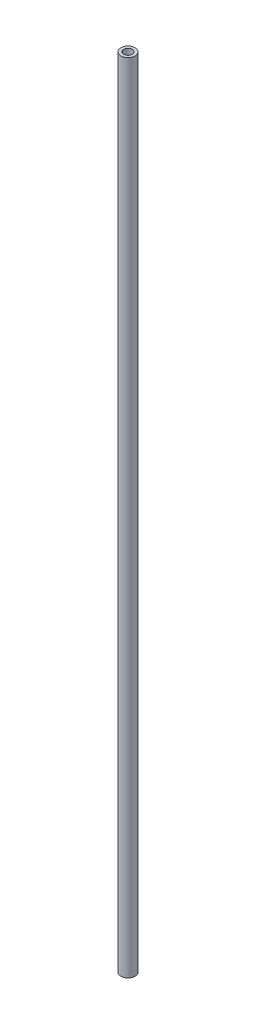
ISO-10303-21;
HEADER;
FILE_DESCRIPTION(('STEP AP214'),'2;1');
FILE_NAME('part.step','',(''),(''),'','','');
FILE_SCHEMA(('AUTOMOTIVE_DESIGN { 1 0 10303 214 1 1 1 1 }'));
ENDSEC;
DATA;
#1=APPLICATION_CONTEXT('core data for automotive mechanical design processes');
#2=APPLICATION_PROTOCOL_DEFINITION('international standard','automotive_design',2000,#1);
#3=PRODUCT_CONTEXT('',#1,'mechanical');
#4=PRODUCT('Part','Part','',(#3));
#5=PRODUCT_RELATED_PRODUCT_CATEGORY('part','',(#4));
#6=PRODUCT_DEFINITION_FORMATION('','',#4);
#7=PRODUCT_DEFINITION_CONTEXT('part definition',#1,'design');
#8=PRODUCT_DEFINITION('design','',#6,#7);
#9=PRODUCT_DEFINITION_SHAPE('','',#8);
#10=(LENGTH_UNIT() NAMED_UNIT(*) SI_UNIT(.MILLI.,.METRE.));
#11=(NAMED_UNIT(*) PLANE_ANGLE_UNIT() SI_UNIT($,.RADIAN.));
#12=(NAMED_UNIT(*) SI_UNIT($,.STERADIAN.) SOLID_ANGLE_UNIT());
#13=UNCERTAINTY_MEASURE_WITH_UNIT(LENGTH_MEASURE(1.E-05),#10,'distance_accuracy_value','');
#14=(GEOMETRIC_REPRESENTATION_CONTEXT(3) GLOBAL_UNCERTAINTY_ASSIGNED_CONTEXT((#13)) GLOBAL_UNIT_ASSIGNED_CONTEXT((#10,
#11,#12)) REPRESENTATION_CONTEXT('',''));
#15=CARTESIAN_POINT('',(0.,0.,0.));
#16=DIRECTION('',(0.,0.,1.));
#17=DIRECTION('',(1.,0.,0.));
#18=AXIS2_PLACEMENT_3D('',#15,#16,#17);
#19=CARTESIAN_POINT('',(0.,140.,0.));
#20=DIRECTION('',(0.,1.,0.));
#21=DIRECTION('',(0.,0.,1.));
#22=AXIS2_PLACEMENT_3D('',#19,#20,#21);
#23=PLANE('',#22);
#24=CARTESIAN_POINT('',(0.,140.,0.));
#25=DIRECTION('',(0.,1.,0.));
#26=DIRECTION('',(0.,0.,1.));
#27=AXIS2_PLACEMENT_3D('',#24,#25,#26);
#28=CIRCLE('',#27,2.5);
#29=CARTESIAN_POINT('',(0.,140.,2.5));
#30=VERTEX_POINT('',#29);
#31=EDGE_CURVE('E11',#30,#30,#28,.T.);
#32=ORIENTED_EDGE('',*,*,#31,.T.);
#33=EDGE_LOOP('',(#32));
#34=FACE_BOUND('',#33,.T.);
#35=CARTESIAN_POINT('',(0.,140.,0.));
#36=DIRECTION('',(0.,1.,0.));
#37=DIRECTION('',(0.,0.,1.));
#38=AXIS2_PLACEMENT_3D('',#35,#36,#37);
#39=CIRCLE('',#38,1.5);
#40=CARTESIAN_POINT('',(0.,140.,1.5));
#41=VERTEX_POINT('',#40);
#42=EDGE_CURVE('E58',#41,#41,#39,.T.);
#43=ORIENTED_EDGE('',*,*,#42,.F.);
#44=EDGE_LOOP('',(#43));
#45=FACE_BOUND('',#44,.T.);
#46=ADVANCED_FACE('F45',(#34,#45),#23,.T.);
#47=CARTESIAN_POINT('',(0.,-140.,0.));
#48=DIRECTION('',(0.,1.,0.));
#49=DIRECTION('',(0.,0.,1.));
#50=AXIS2_PLACEMENT_3D('',#47,#48,#49);
#51=PLANE('',#50);
#52=CARTESIAN_POINT('',(0.,-140.,0.));
#53=DIRECTION('',(0.,1.,0.));
#54=DIRECTION('',(0.,0.,1.));
#55=AXIS2_PLACEMENT_3D('',#52,#53,#54);
#56=CIRCLE('',#55,2.5);
#57=CARTESIAN_POINT('',(0.,-140.,2.5));
#58=VERTEX_POINT('',#57);
#59=EDGE_CURVE('E49',#58,#58,#56,.T.);
#60=ORIENTED_EDGE('',*,*,#59,.F.);
#61=EDGE_LOOP('',(#60));
#62=FACE_BOUND('',#61,.T.);
#63=CARTESIAN_POINT('',(0.,-140.,0.));
#64=DIRECTION('',(0.,1.,0.));
#65=DIRECTION('',(0.,0.,1.));
#66=AXIS2_PLACEMENT_3D('',#63,#64,#65);
#67=CIRCLE('',#66,1.5);
#68=CARTESIAN_POINT('',(0.,-140.,1.5));
#69=VERTEX_POINT('',#68);
#70=EDGE_CURVE('E60',#69,#69,#67,.T.);
#71=ORIENTED_EDGE('',*,*,#70,.T.);
#72=EDGE_LOOP('',(#71));
#73=FACE_BOUND('',#72,.T.);
#74=ADVANCED_FACE('F72',(#62,#73),#51,.F.);
#75=CARTESIAN_POINT('',(0.,140.,0.));
#76=DIRECTION('',(0.,-1.,0.));
#77=DIRECTION('',(0.,0.,-1.));
#78=AXIS2_PLACEMENT_3D('',#75,#76,#77);
#79=CYLINDRICAL_SURFACE('',#78,2.5);
#80=ORIENTED_EDGE('',*,*,#31,.F.);
#81=EDGE_LOOP('',(#80));
#82=FACE_BOUND('',#81,.T.);
#83=ORIENTED_EDGE('',*,*,#59,.T.);
#84=EDGE_LOOP('',(#83));
#85=FACE_BOUND('',#84,.T.);
#86=ADVANCED_FACE('F47',(#82,#85),#79,.T.);
#87=CARTESIAN_POINT('',(0.,140.,0.));
#88=DIRECTION('',(0.,-1.,0.));
#89=DIRECTION('',(0.,0.,-1.));
#90=AXIS2_PLACEMENT_3D('',#87,#88,#89);
#91=CYLINDRICAL_SURFACE('',#90,1.5);
#92=ORIENTED_EDGE('',*,*,#42,.T.);
#93=EDGE_LOOP('',(#92));
#94=FACE_BOUND('',#93,.T.);
#95=ORIENTED_EDGE('',*,*,#70,.F.);
#96=EDGE_LOOP('',(#95));
#97=FACE_BOUND('',#96,.T.);
#98=ADVANCED_FACE('F68',(#94,#97),#91,.F.);
#99=CLOSED_SHELL('',(#46,#74,#86,#98));
#100=MANIFOLD_SOLID_BREP('B2',#99);
#101=ADVANCED_BREP_SHAPE_REPRESENTATION('',(#18,#100),#14);
#102=SHAPE_DEFINITION_REPRESENTATION(#9,#101);
ENDSEC;
END-ISO-10303-21;
